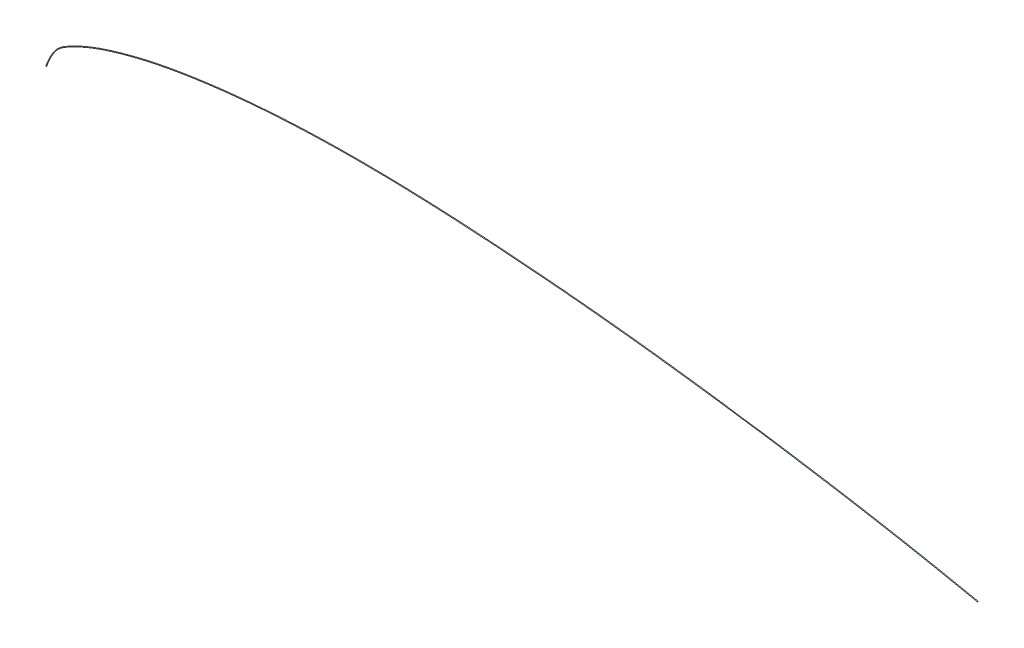
ISO-10303-21;
HEADER;
FILE_DESCRIPTION(('STEP AP214'),'2;1');
FILE_NAME('part.step','',(''),(''),'','','');
FILE_SCHEMA(('AUTOMOTIVE_DESIGN { 1 0 10303 214 1 1 1 1 }'));
ENDSEC;
DATA;
#1=APPLICATION_CONTEXT('core data for automotive mechanical design processes');
#2=APPLICATION_PROTOCOL_DEFINITION('international standard','automotive_design',2000,#1);
#3=PRODUCT_CONTEXT('',#1,'mechanical');
#4=PRODUCT('Part','Part','',(#3));
#5=PRODUCT_RELATED_PRODUCT_CATEGORY('part','',(#4));
#6=PRODUCT_DEFINITION_FORMATION('','',#4);
#7=PRODUCT_DEFINITION_CONTEXT('part definition',#1,'design');
#8=PRODUCT_DEFINITION('design','',#6,#7);
#9=PRODUCT_DEFINITION_SHAPE('','',#8);
#10=(LENGTH_UNIT() NAMED_UNIT(*) SI_UNIT(.MILLI.,.METRE.));
#11=(NAMED_UNIT(*) PLANE_ANGLE_UNIT() SI_UNIT($,.RADIAN.));
#12=(NAMED_UNIT(*) SI_UNIT($,.STERADIAN.) SOLID_ANGLE_UNIT());
#13=UNCERTAINTY_MEASURE_WITH_UNIT(LENGTH_MEASURE(1.E-05),#10,'distance_accuracy_value','');
#14=(GEOMETRIC_REPRESENTATION_CONTEXT(3) GLOBAL_UNCERTAINTY_ASSIGNED_CONTEXT((#13)) GLOBAL_UNIT_ASSIGNED_CONTEXT((#10,
#11,#12)) REPRESENTATION_CONTEXT('',''));
#15=CARTESIAN_POINT('',(0.,0.,0.));
#16=DIRECTION('',(0.,0.,1.));
#17=DIRECTION('',(1.,0.,0.));
#18=AXIS2_PLACEMENT_3D('',#15,#16,#17);
#19=CARTESIAN_POINT('',(1304.66,1.696058,0.));
#20=DIRECTION('',(0.98101772640487,0.193918076721638,0.));
#21=DIRECTION('',(0.,0.,1.));
#22=AXIS2_PLACEMENT_3D('',#19,#20,#21);
#23=PLANE('',#22);
#24=CARTESIAN_POINT('',(1304.66,1.696058,0.));
#25=DIRECTION('',(0.98101772640487,0.193918076721638,0.));
#26=DIRECTION('',(0.,0.,1.));
#27=AXIS2_PLACEMENT_3D('',#24,#25,#26);
#28=CIRCLE('',#27,0.5);
#29=CARTESIAN_POINT('',(1304.66,1.696058,0.5));
#30=VERTEX_POINT('',#29);
#31=EDGE_CURVE('E10',#30,#30,#28,.T.);
#32=ORIENTED_EDGE('',*,*,#31,.T.);
#33=EDGE_LOOP('',(#32));
#34=FACE_BOUND('',#33,.T.);
#35=ADVANCED_FACE('F39',(#34),#23,.T.);
#36=CARTESIAN_POINT('',(1304.66,1.696058,0.5));
#37=CARTESIAN_POINT('',(1282.92772693694,6.14929782340755,0.5));
#38=CARTESIAN_POINT('',(1261.195453882,10.6025376463355,0.5));
#39=CARTESIAN_POINT('',(1206.93838618714,21.2468164795281,0.5));
#40=CARTESIAN_POINT('',(1174.37031889667,27.2178116733628,0.5));
#41=CARTESIAN_POINT('',(1109.1263992094,38.5316321126376,0.5));
#42=CARTESIAN_POINT('',(1076.44825562522,43.8660900637924,0.5));
#43=CARTESIAN_POINT('',(1000.31155481095,55.6370762839409,0.5));
#44=CARTESIAN_POINT('',(956.820964703096,61.8638164249425,0.5));
#45=CARTESIAN_POINT('',(869.842521959019,73.2806504857611,0.5));
#46=CARTESIAN_POINT('',(826.355106530212,78.4740001523558,0.5));
#47=CARTESIAN_POINT('',(739.3698456084,87.4650095892404,0.5));
#48=CARTESIAN_POINT('',(695.872437072038,91.2668809355757,0.5));
#49=CARTESIAN_POINT('',(608.887227843404,97.6405842757081,0.5));
#50=CARTESIAN_POINT('',(565.399633056471,100.215211806732,0.5));
#51=CARTESIAN_POINT('',(478.395079739289,103.309375670061,0.5));
#52=CARTESIAN_POINT('',(434.878268327016,103.83205512042,0.5));
#53=CARTESIAN_POINT('',(347.826991695691,101.780222102428,0.5));
#54=CARTESIAN_POINT('',(304.279102157574,99.2352342375905,0.5));
#55=CARTESIAN_POINT('',(239.007528356002,92.4337100888985,0.5));
#56=CARTESIAN_POINT('',(217.137883231133,89.6354637061965,0.5));
#57=CARTESIAN_POINT('',(173.5760451149,82.7322944815344,0.5));
#58=CARTESIAN_POINT('',(151.884626005489,78.6259584178591,0.5));
#59=CARTESIAN_POINT('',(119.431730282466,70.7870655388134,0.5));
#60=CARTESIAN_POINT('',(108.469841313403,67.8385442853681,0.5));
#61=CARTESIAN_POINT('',(86.6531895763216,61.4142545774094,0.5));
#62=CARTESIAN_POINT('',(75.800572724708,57.9356519815337,0.5));
#63=CARTESIAN_POINT('',(58.4131300467896,51.2666959353052,0.5));
#64=CARTESIAN_POINT('',(51.711977333901,48.4116238929897,0.5));
#65=CARTESIAN_POINT('',(41.7677494726042,43.7114014230806,0.5));
#66=CARTESIAN_POINT('',(38.4709237202427,42.0750581987962,0.5));
#67=CARTESIAN_POINT('',(31.9013435093909,38.653392041473,0.5));
#68=CARTESIAN_POINT('',(28.5984661307997,36.8885624123483,0.5));
#69=CARTESIAN_POINT('',(22.2960932132934,33.0021250024146,0.5));
#70=CARTESIAN_POINT('',(19.3072364724937,30.8732794068314,0.5));
#71=CARTESIAN_POINT('',(14.0650864369098,25.9470099814017,0.5));
#72=CARTESIAN_POINT('',(11.8264044231569,23.1380015646142,0.5));
#73=CARTESIAN_POINT('',(5.88042116155558,14.0150452066754,0.5));
#74=CARTESIAN_POINT('',(2.94021057981981,7.00752260419467,0.5));
#75=CARTESIAN_POINT('',(0.,0.,0.5));
#76=CARTESIAN_POINT('',(1304.85391807672,0.71504027359513,0.5));
#77=CARTESIAN_POINT('',(1283.1216450112,5.16828009701831,0.5));
#78=CARTESIAN_POINT('',(1261.39211909736,9.62205097838318,0.5));
#79=CARTESIAN_POINT('',(1207.14871082492,20.2691492072442,0.5));
#80=CARTESIAN_POINT('',(1174.58755684666,26.2416707466145,0.5));
#81=CARTESIAN_POINT('',(1109.35648443649,37.5584393134051,0.5));
#82=CARTESIAN_POINT('',(1076.68427507403,42.8943254938844,0.5));
#83=CARTESIAN_POINT('',(1000.56025923444,54.6684681733289,0.5));
#84=CARTESIAN_POINT('',(957.077048031174,60.8971302794565,0.5));
#85=CARTESIAN_POINT('',(870.113621413838,72.3180677764635,0.5));
#86=CARTESIAN_POINT('',(826.635030147962,77.5139196283311,0.5));
#87=CARTESIAN_POINT('',(739.669980471018,86.5110545440057,0.5));
#88=CARTESIAN_POINT('',(696.182045583137,90.3159707432014,0.5));
#89=CARTESIAN_POINT('',(609.21456273342,96.6956297302292,0.5));
#90=CARTESIAN_POINT('',(565.738812751709,99.2743588163506,0.5));
#91=CARTESIAN_POINT('',(478.763648082635,102.379642465031,0.5));
#92=CARTESIAN_POINT('',(435.265134839953,102.909614172309,0.5));
#93=CARTESIAN_POINT('',(348.257218143032,100.877188017373,0.5));
#94=CARTESIAN_POINT('',(304.732401335284,98.3433407876192,0.5));
#95=CARTESIAN_POINT('',(239.501620102466,91.5641599649611,0.5));
#96=CARTESIAN_POINT('',(217.647362295906,88.7747488836073,0.5));
#97=CARTESIAN_POINT('',(174.119486365586,81.8926097012969,0.5));
#98=CARTESIAN_POINT('',(152.450377648477,77.8007095587956,0.5));
#99=CARTESIAN_POINT('',(120.038154950003,69.9917392674306,0.5));
#100=CARTESIAN_POINT('',(109.089130187921,67.0532199258716,0.5));
#101=CARTESIAN_POINT('',(87.2971444218757,60.6490257118598,0.5));
#102=CARTESIAN_POINT('',(76.4648666324215,57.1872347828332,0.5));
#103=CARTESIAN_POINT('',(59.12213099632,50.5610707814937,0.5));
#104=CARTESIAN_POINT('',(52.4386672790084,47.7241789003536,0.5));
#105=CARTESIAN_POINT('',(42.5201732156656,43.052597025368,0.5));
#106=CARTESIAN_POINT('',(39.2317929793971,41.4260249191439,0.5));
#107=CARTESIAN_POINT('',(32.6786929545262,38.0241909068752,0.5));
#108=CARTESIAN_POINT('',(29.3863151815706,36.2711388312426,0.5));
#109=CARTESIAN_POINT('',(23.1349025019732,32.4559409835558,0.5));
#110=CARTESIAN_POINT('',(20.1832806038605,30.3823821131525,0.5));
#111=CARTESIAN_POINT('',(15.0158859986617,25.6238789457748,0.5));
#112=CARTESIAN_POINT('',(12.7989611667208,22.8970651692601,0.5));
#113=CARTESIAN_POINT('',(6.88665507478732,13.9588208663837,0.5));
#114=CARTESIAN_POINT('',(3.94021057981981,7.00752260419594,0.5));
#115=CARTESIAN_POINT('',(1.,0.,0.5));
#116=CARTESIAN_POINT('',(1304.85391807672,0.71504027359513,-0.5));
#117=CARTESIAN_POINT('',(1283.1216450112,5.16828009701831,-0.5));
#118=CARTESIAN_POINT('',(1261.39211909736,9.62205097838318,-0.5));
#119=CARTESIAN_POINT('',(1207.14871082492,20.2691492072442,-0.5));
#120=CARTESIAN_POINT('',(1174.58755684666,26.2416707466145,-0.5));
#121=CARTESIAN_POINT('',(1109.35648443649,37.5584393134051,-0.5));
#122=CARTESIAN_POINT('',(1076.68427507403,42.8943254938844,-0.5));
#123=CARTESIAN_POINT('',(1000.56025923444,54.6684681733289,-0.5));
#124=CARTESIAN_POINT('',(957.077048031174,60.8971302794565,-0.5));
#125=CARTESIAN_POINT('',(870.113621413838,72.3180677764635,-0.5));
#126=CARTESIAN_POINT('',(826.635030147962,77.5139196283311,-0.5));
#127=CARTESIAN_POINT('',(739.669980471018,86.5110545440057,-0.5));
#128=CARTESIAN_POINT('',(696.182045583137,90.3159707432014,-0.5));
#129=CARTESIAN_POINT('',(609.21456273342,96.6956297302292,-0.5));
#130=CARTESIAN_POINT('',(565.738812751709,99.2743588163506,-0.5));
#131=CARTESIAN_POINT('',(478.763648082635,102.379642465031,-0.5));
#132=CARTESIAN_POINT('',(435.265134839953,102.909614172309,-0.5));
#133=CARTESIAN_POINT('',(348.257218143032,100.877188017373,-0.5));
#134=CARTESIAN_POINT('',(304.732401335284,98.3433407876192,-0.5));
#135=CARTESIAN_POINT('',(239.501620102466,91.5641599649611,-0.5));
#136=CARTESIAN_POINT('',(217.647362295906,88.7747488836073,-0.5));
#137=CARTESIAN_POINT('',(174.119486365586,81.8926097012969,-0.5));
#138=CARTESIAN_POINT('',(152.450377648477,77.8007095587956,-0.5));
#139=CARTESIAN_POINT('',(120.038154950003,69.9917392674306,-0.5));
#140=CARTESIAN_POINT('',(109.089130187921,67.0532199258716,-0.5));
#141=CARTESIAN_POINT('',(87.2971444218757,60.6490257118598,-0.5));
#142=CARTESIAN_POINT('',(76.4648666324215,57.1872347828332,-0.5));
#143=CARTESIAN_POINT('',(59.12213099632,50.5610707814937,-0.5));
#144=CARTESIAN_POINT('',(52.4386672790084,47.7241789003536,-0.5));
#145=CARTESIAN_POINT('',(42.5201732156656,43.052597025368,-0.5));
#146=CARTESIAN_POINT('',(39.2317929793971,41.4260249191439,-0.5));
#147=CARTESIAN_POINT('',(32.6786929545262,38.0241909068752,-0.5));
#148=CARTESIAN_POINT('',(29.3863151815706,36.2711388312426,-0.5));
#149=CARTESIAN_POINT('',(23.1349025019732,32.4559409835558,-0.5));
#150=CARTESIAN_POINT('',(20.1832806038605,30.3823821131525,-0.5));
#151=CARTESIAN_POINT('',(15.0158859986617,25.6238789457748,-0.5));
#152=CARTESIAN_POINT('',(12.7989611667208,22.8970651692601,-0.5));
#153=CARTESIAN_POINT('',(6.88665507478732,13.9588208663837,-0.5));
#154=CARTESIAN_POINT('',(3.94021057981981,7.00752260419594,-0.5));
#155=CARTESIAN_POINT('',(1.,0.,-0.5));
#156=CARTESIAN_POINT('',(1304.66,1.696058,-0.5));
#157=CARTESIAN_POINT('',(1282.92772693694,6.14929782340755,-0.5));
#158=CARTESIAN_POINT('',(1261.195453882,10.6025376463355,-0.5));
#159=CARTESIAN_POINT('',(1206.93838618714,21.2468164795281,-0.5));
#160=CARTESIAN_POINT('',(1174.37031889667,27.2178116733628,-0.5));
#161=CARTESIAN_POINT('',(1109.1263992094,38.5316321126376,-0.5));
#162=CARTESIAN_POINT('',(1076.44825562522,43.8660900637924,-0.5));
#163=CARTESIAN_POINT('',(1000.31155481095,55.6370762839409,-0.5));
#164=CARTESIAN_POINT('',(956.820964703096,61.8638164249425,-0.5));
#165=CARTESIAN_POINT('',(869.842521959019,73.2806504857611,-0.5));
#166=CARTESIAN_POINT('',(826.355106530212,78.4740001523558,-0.5));
#167=CARTESIAN_POINT('',(739.3698456084,87.4650095892404,-0.5));
#168=CARTESIAN_POINT('',(695.872437072038,91.2668809355757,-0.5));
#169=CARTESIAN_POINT('',(608.887227843404,97.6405842757081,-0.5));
#170=CARTESIAN_POINT('',(565.399633056471,100.215211806732,-0.5));
#171=CARTESIAN_POINT('',(478.395079739289,103.309375670061,-0.5));
#172=CARTESIAN_POINT('',(434.878268327016,103.83205512042,-0.5));
#173=CARTESIAN_POINT('',(347.826991695691,101.780222102428,-0.5));
#174=CARTESIAN_POINT('',(304.279102157574,99.2352342375905,-0.5));
#175=CARTESIAN_POINT('',(239.007528356002,92.4337100888985,-0.5));
#176=CARTESIAN_POINT('',(217.137883231133,89.6354637061965,-0.5));
#177=CARTESIAN_POINT('',(173.5760451149,82.7322944815344,-0.5));
#178=CARTESIAN_POINT('',(151.884626005489,78.6259584178591,-0.5));
#179=CARTESIAN_POINT('',(119.431730282466,70.7870655388134,-0.5));
#180=CARTESIAN_POINT('',(108.469841313403,67.8385442853681,-0.5));
#181=CARTESIAN_POINT('',(86.6531895763216,61.4142545774094,-0.5));
#182=CARTESIAN_POINT('',(75.800572724708,57.9356519815337,-0.5));
#183=CARTESIAN_POINT('',(58.4131300467896,51.2666959353052,-0.5));
#184=CARTESIAN_POINT('',(51.711977333901,48.4116238929897,-0.5));
#185=CARTESIAN_POINT('',(41.7677494726042,43.7114014230806,-0.5));
#186=CARTESIAN_POINT('',(38.4709237202427,42.0750581987962,-0.5));
#187=CARTESIAN_POINT('',(31.9013435093909,38.653392041473,-0.5));
#188=CARTESIAN_POINT('',(28.5984661307997,36.8885624123483,-0.5));
#189=CARTESIAN_POINT('',(22.2960932132934,33.0021250024146,-0.5));
#190=CARTESIAN_POINT('',(19.3072364724937,30.8732794068314,-0.5));
#191=CARTESIAN_POINT('',(14.0650864369098,25.9470099814017,-0.5));
#192=CARTESIAN_POINT('',(11.8264044231569,23.1380015646142,-0.5));
#193=CARTESIAN_POINT('',(5.88042116155558,14.0150452066754,-0.5));
#194=CARTESIAN_POINT('',(2.94021057981981,7.00752260419467,-0.5));
#195=CARTESIAN_POINT('',(0.,0.,-0.5));
#196=CARTESIAN_POINT('',(1304.46608192328,2.67707572640487,-0.5));
#197=CARTESIAN_POINT('',(1282.73380886268,7.13031554979678,-0.5));
#198=CARTESIAN_POINT('',(1260.99878866664,11.5830243142878,-0.5));
#199=CARTESIAN_POINT('',(1206.72806154937,22.2244837518121,-0.5));
#200=CARTESIAN_POINT('',(1174.15308094667,28.1939526001111,-0.5));
#201=CARTESIAN_POINT('',(1108.89631398231,39.5048249118702,-0.5));
#202=CARTESIAN_POINT('',(1076.2122361764,44.8378546337004,-0.5));
#203=CARTESIAN_POINT('',(1000.06285038746,56.605684394553,-0.5));
#204=CARTESIAN_POINT('',(956.564881375017,62.8305025704285,-0.5));
#205=CARTESIAN_POINT('',(869.5714225042,74.2432331950586,-0.5));
#206=CARTESIAN_POINT('',(826.075182912462,79.4340806763805,-0.5));
#207=CARTESIAN_POINT('',(739.069710745781,88.4189646344751,-0.5));
#208=CARTESIAN_POINT('',(695.562828560939,92.21779112795,-0.5));
#209=CARTESIAN_POINT('',(608.559892953388,98.5855388211869,-0.5));
#210=CARTESIAN_POINT('',(565.060453361233,101.156064797113,-0.5));
#211=CARTESIAN_POINT('',(478.026511395943,104.239108875092,-0.5));
#212=CARTESIAN_POINT('',(434.491401814078,104.754496068532,-0.5));
#213=CARTESIAN_POINT('',(347.39676524835,102.683256187484,-0.5));
#214=CARTESIAN_POINT('',(303.825802979864,100.127127687562,-0.5));
#215=CARTESIAN_POINT('',(238.513436609538,93.3032602128359,-0.5));
#216=CARTESIAN_POINT('',(216.62840416636,90.4961785287856,-0.5));
#217=CARTESIAN_POINT('',(173.032603864213,83.5719792617719,-0.5));
#218=CARTESIAN_POINT('',(151.3188743625,79.4512072769225,-0.5));
#219=CARTESIAN_POINT('',(118.825305614928,71.5823918101961,-0.5));
#220=CARTESIAN_POINT('',(107.850552438886,68.6238686448646,-0.5));
#221=CARTESIAN_POINT('',(86.0092347307675,62.1794834429589,-0.5));
#222=CARTESIAN_POINT('',(75.1362788169945,58.6840691802343,-0.5));
#223=CARTESIAN_POINT('',(57.7041290972591,51.9723210891166,-0.5));
#224=CARTESIAN_POINT('',(50.9852873887935,49.0990688856258,-0.5));
#225=CARTESIAN_POINT('',(41.0153257295429,44.3702058207931,-0.5));
#226=CARTESIAN_POINT('',(37.7100544610884,42.7240914784485,-0.5));
#227=CARTESIAN_POINT('',(31.1239940642555,39.2825931760708,-0.5));
#228=CARTESIAN_POINT('',(27.8106170800288,37.5059859934541,-0.5));
#229=CARTESIAN_POINT('',(21.4572839246135,33.5483090212734,-0.5));
#230=CARTESIAN_POINT('',(18.431192341127,31.3641767005103,-0.5));
#231=CARTESIAN_POINT('',(13.1142868751578,26.2701410170286,-0.5));
#232=CARTESIAN_POINT('',(10.8538476795929,23.3789379599684,-0.5));
#233=CARTESIAN_POINT('',(4.87418724832385,14.0712695469671,-0.5));
#234=CARTESIAN_POINT('',(1.94021057981981,7.00752260419341,-0.5));
#235=CARTESIAN_POINT('',(-1.,0.,-0.5));
#236=CARTESIAN_POINT('',(1304.46608192328,2.67707572640487,0.5));
#237=CARTESIAN_POINT('',(1282.73380886268,7.13031554979678,0.5));
#238=CARTESIAN_POINT('',(1260.99878866664,11.5830243142878,0.5));
#239=CARTESIAN_POINT('',(1206.72806154937,22.2244837518121,0.5));
#240=CARTESIAN_POINT('',(1174.15308094667,28.1939526001111,0.5));
#241=CARTESIAN_POINT('',(1108.89631398231,39.5048249118702,0.5));
#242=CARTESIAN_POINT('',(1076.2122361764,44.8378546337004,0.5));
#243=CARTESIAN_POINT('',(1000.06285038746,56.605684394553,0.5));
#244=CARTESIAN_POINT('',(956.564881375017,62.8305025704285,0.5));
#245=CARTESIAN_POINT('',(869.5714225042,74.2432331950586,0.5));
#246=CARTESIAN_POINT('',(826.075182912462,79.4340806763805,0.5));
#247=CARTESIAN_POINT('',(739.069710745781,88.4189646344751,0.5));
#248=CARTESIAN_POINT('',(695.562828560939,92.21779112795,0.5));
#249=CARTESIAN_POINT('',(608.559892953388,98.5855388211869,0.5));
#250=CARTESIAN_POINT('',(565.060453361233,101.156064797113,0.5));
#251=CARTESIAN_POINT('',(478.026511395943,104.239108875092,0.5));
#252=CARTESIAN_POINT('',(434.491401814078,104.754496068532,0.5));
#253=CARTESIAN_POINT('',(347.39676524835,102.683256187484,0.5));
#254=CARTESIAN_POINT('',(303.825802979864,100.127127687562,0.5));
#255=CARTESIAN_POINT('',(238.513436609538,93.3032602128359,0.5));
#256=CARTESIAN_POINT('',(216.62840416636,90.4961785287856,0.5));
#257=CARTESIAN_POINT('',(173.032603864213,83.5719792617719,0.5));
#258=CARTESIAN_POINT('',(151.3188743625,79.4512072769225,0.5));
#259=CARTESIAN_POINT('',(118.825305614928,71.5823918101961,0.5));
#260=CARTESIAN_POINT('',(107.850552438886,68.6238686448646,0.5));
#261=CARTESIAN_POINT('',(86.0092347307675,62.1794834429589,0.5));
#262=CARTESIAN_POINT('',(75.1362788169945,58.6840691802343,0.5));
#263=CARTESIAN_POINT('',(57.7041290972591,51.9723210891166,0.5));
#264=CARTESIAN_POINT('',(50.9852873887935,49.0990688856258,0.5));
#265=CARTESIAN_POINT('',(41.0153257295429,44.3702058207931,0.5));
#266=CARTESIAN_POINT('',(37.7100544610884,42.7240914784485,0.5));
#267=CARTESIAN_POINT('',(31.1239940642555,39.2825931760708,0.5));
#268=CARTESIAN_POINT('',(27.8106170800288,37.5059859934541,0.5));
#269=CARTESIAN_POINT('',(21.4572839246135,33.5483090212734,0.5));
#270=CARTESIAN_POINT('',(18.431192341127,31.3641767005103,0.5));
#271=CARTESIAN_POINT('',(13.1142868751578,26.2701410170286,0.5));
#272=CARTESIAN_POINT('',(10.8538476795929,23.3789379599684,0.5));
#273=CARTESIAN_POINT('',(4.87418724832385,14.0712695469671,0.5));
#274=CARTESIAN_POINT('',(1.94021057981981,7.00752260419341,0.5));
#275=CARTESIAN_POINT('',(-1.,0.,0.5));
#276=CARTESIAN_POINT('',(1304.66,1.696058,0.5));
#277=CARTESIAN_POINT('',(1282.92772693694,6.14929782340755,0.5));
#278=CARTESIAN_POINT('',(1261.195453882,10.6025376463355,0.5));
#279=CARTESIAN_POINT('',(1206.93838618714,21.2468164795281,0.5));
#280=CARTESIAN_POINT('',(1174.37031889667,27.2178116733628,0.5));
#281=CARTESIAN_POINT('',(1109.1263992094,38.5316321126376,0.5));
#282=CARTESIAN_POINT('',(1076.44825562522,43.8660900637924,0.5));
#283=CARTESIAN_POINT('',(1000.31155481095,55.6370762839409,0.5));
#284=CARTESIAN_POINT('',(956.820964703096,61.8638164249425,0.5));
#285=CARTESIAN_POINT('',(869.842521959019,73.2806504857611,0.5));
#286=CARTESIAN_POINT('',(826.355106530212,78.4740001523558,0.5));
#287=CARTESIAN_POINT('',(739.3698456084,87.4650095892404,0.5));
#288=CARTESIAN_POINT('',(695.872437072038,91.2668809355757,0.5));
#289=CARTESIAN_POINT('',(608.887227843404,97.6405842757081,0.5));
#290=CARTESIAN_POINT('',(565.399633056471,100.215211806732,0.5));
#291=CARTESIAN_POINT('',(478.395079739289,103.309375670061,0.5));
#292=CARTESIAN_POINT('',(434.878268327016,103.83205512042,0.5));
#293=CARTESIAN_POINT('',(347.826991695691,101.780222102428,0.5));
#294=CARTESIAN_POINT('',(304.279102157574,99.2352342375905,0.5));
#295=CARTESIAN_POINT('',(239.007528356002,92.4337100888985,0.5));
#296=CARTESIAN_POINT('',(217.137883231133,89.6354637061965,0.5));
#297=CARTESIAN_POINT('',(173.5760451149,82.7322944815344,0.5));
#298=CARTESIAN_POINT('',(151.884626005489,78.6259584178591,0.5));
#299=CARTESIAN_POINT('',(119.431730282466,70.7870655388134,0.5));
#300=CARTESIAN_POINT('',(108.469841313403,67.8385442853681,0.5));
#301=CARTESIAN_POINT('',(86.6531895763216,61.4142545774094,0.5));
#302=CARTESIAN_POINT('',(75.800572724708,57.9356519815337,0.5));
#303=CARTESIAN_POINT('',(58.4131300467896,51.2666959353052,0.5));
#304=CARTESIAN_POINT('',(51.711977333901,48.4116238929897,0.5));
#305=CARTESIAN_POINT('',(41.7677494726042,43.7114014230806,0.5));
#306=CARTESIAN_POINT('',(38.4709237202427,42.0750581987962,0.5));
#307=CARTESIAN_POINT('',(31.9013435093909,38.653392041473,0.5));
#308=CARTESIAN_POINT('',(28.5984661307997,36.8885624123483,0.5));
#309=CARTESIAN_POINT('',(22.2960932132934,33.0021250024146,0.5));
#310=CARTESIAN_POINT('',(19.3072364724937,30.8732794068314,0.5));
#311=CARTESIAN_POINT('',(14.0650864369098,25.9470099814017,0.5));
#312=CARTESIAN_POINT('',(11.8264044231569,23.1380015646142,0.5));
#313=CARTESIAN_POINT('',(5.88042116155558,14.0150452066754,0.5));
#314=CARTESIAN_POINT('',(2.94021057981981,7.00752260419467,0.5));
#315=CARTESIAN_POINT('',(0.,0.,0.5));
#316=(BOUNDED_SURFACE() B_SPLINE_SURFACE(3,3,((#36,#37,#38,#39,#40,#41,#42,#43,#44,#45,#46,#47,
#48,#49,#50,#51,#52,#53,#54,#55,#56,#57,#58,#59,#60,#61,#62,#63,#64,#65,#66,#67,#68,#69,#70,#71,
#72,#73,#74,#75),(#76,#77,#78,#79,#80,#81,#82,#83,#84,#85,#86,#87,#88,#89,#90,#91,#92,#93,#94,
#95,#96,#97,#98,#99,#100,#101,#102,#103,#104,#105,#106,#107,#108,#109,#110,#111,#112,#113,#114,
#115),(#116,#117,#118,#119,#120,#121,#122,#123,#124,#125,#126,#127,#128,#129,#130,#131,#132,
#133,#134,#135,#136,#137,#138,#139,#140,#141,#142,#143,#144,#145,#146,#147,#148,#149,#150,#151,
#152,#153,#154,#155),(#156,#157,#158,#159,#160,#161,#162,#163,#164,#165,#166,#167,#168,#169,
#170,#171,#172,#173,#174,#175,#176,#177,#178,#179,#180,#181,#182,#183,#184,#185,#186,#187,#188,
#189,#190,#191,#192,#193,#194,#195),(#196,#197,#198,#199,#200,#201,#202,#203,#204,#205,#206,
#207,#208,#209,#210,#211,#212,#213,#214,#215,#216,#217,#218,#219,#220,#221,#222,#223,#224,#225,
#226,#227,#228,#229,#230,#231,#232,#233,#234,#235),(#236,#237,#238,#239,#240,#241,#242,#243,
#244,#245,#246,#247,#248,#249,#250,#251,#252,#253,#254,#255,#256,#257,#258,#259,#260,#261,#262,
#263,#264,#265,#266,#267,#268,#269,#270,#271,#272,#273,#274,#275),(#276,#277,#278,#279,#280,
#281,#282,#283,#284,#285,#286,#287,#288,#289,#290,#291,#292,#293,#294,#295,#296,#297,#298,#299,
#300,#301,#302,#303,#304,#305,#306,#307,#308,#309,#310,#311,#312,#313,#314,#315)),.UNSPECIFIED.,
.T.,.F.,.F.) B_SPLINE_SURFACE_WITH_KNOTS((4,3,4),(4,2,2,2,2,2,2,2,2,2,2,2,2,2,2,2,2,2,2,4),(0.,
0.5,1.),(0.,0.0496812988513006,0.123828803347963,0.197976307844626,0.296362491062684,
0.394433617199178,0.492205408317245,0.589753408165242,0.687151928165724,0.784753711389578,
0.834119584128113,0.883485456866648,0.908917356863356,0.934349256860064,0.950761942645048,
0.95896828553754,0.967174628430032,0.975380971322524,0.983587314215016,1.),
.UNSPECIFIED.) GEOMETRIC_REPRESENTATION_ITEM() RATIONAL_B_SPLINE_SURFACE(((1.,1.,1.,1.,1.,1.,1.,
1.,1.,1.,1.,1.,1.,1.,1.,1.,1.,1.,1.,1.,1.,1.,1.,1.,1.,1.,1.,1.,1.,1.,1.,1.,1.,1.,1.,1.,1.,1.,1.,
1.),(0.333333333333333,0.333333333333333,0.333333333333333,0.333333333333333,0.333333333333333,
0.333333333333333,0.333333333333333,0.333333333333333,0.333333333333333,0.333333333333333,
0.333333333333333,0.333333333333333,0.333333333333333,0.333333333333333,0.333333333333333,
0.333333333333333,0.333333333333333,0.333333333333333,0.333333333333333,0.333333333333333,
0.333333333333333,0.333333333333333,0.333333333333333,0.333333333333333,0.333333333333333,
0.333333333333333,0.333333333333333,0.333333333333333,0.333333333333333,0.333333333333333,
0.333333333333333,0.333333333333333,0.333333333333333,0.333333333333333,0.333333333333333,
0.333333333333333,0.333333333333333,0.333333333333333,0.333333333333333,0.333333333333333),
(0.333333333333333,0.333333333333333,0.333333333333333,0.333333333333333,0.333333333333333,
0.333333333333333,0.333333333333333,0.333333333333333,0.333333333333333,0.333333333333333,
0.333333333333333,0.333333333333333,0.333333333333333,0.333333333333333,0.333333333333333,
0.333333333333333,0.333333333333333,0.333333333333333,0.333333333333333,0.333333333333333,
0.333333333333333,0.333333333333333,0.333333333333333,0.333333333333333,0.333333333333333,
0.333333333333333,0.333333333333333,0.333333333333333,0.333333333333333,0.333333333333333,
0.333333333333333,0.333333333333333,0.333333333333333,0.333333333333333,0.333333333333333,
0.333333333333333,0.333333333333333,0.333333333333333,0.333333333333333,0.333333333333333),(1.,
1.,1.,1.,1.,1.,1.,1.,1.,1.,1.,1.,1.,1.,1.,1.,1.,1.,1.,1.,1.,1.,1.,1.,1.,1.,1.,1.,1.,1.,1.,1.,1.,
1.,1.,1.,1.,1.,1.,1.),(0.333333333333333,0.333333333333333,0.333333333333333,0.333333333333333,
0.333333333333333,0.333333333333333,0.333333333333333,0.333333333333333,0.333333333333333,
0.333333333333333,0.333333333333333,0.333333333333333,0.333333333333333,0.333333333333333,
0.333333333333333,0.333333333333333,0.333333333333333,0.333333333333333,0.333333333333333,
0.333333333333333,0.333333333333333,0.333333333333333,0.333333333333333,0.333333333333333,
0.333333333333333,0.333333333333333,0.333333333333333,0.333333333333333,0.333333333333333,
0.333333333333333,0.333333333333333,0.333333333333333,0.333333333333333,0.333333333333333,
0.333333333333333,0.333333333333333,0.333333333333333,0.333333333333333,0.333333333333333,
0.333333333333333),(0.333333333333333,0.333333333333333,0.333333333333333,0.333333333333333,
0.333333333333333,0.333333333333333,0.333333333333333,0.333333333333333,0.333333333333333,
0.333333333333333,0.333333333333333,0.333333333333333,0.333333333333333,0.333333333333333,
0.333333333333333,0.333333333333333,0.333333333333333,0.333333333333333,0.333333333333333,
0.333333333333333,0.333333333333333,0.333333333333333,0.333333333333333,0.333333333333333,
0.333333333333333,0.333333333333333,0.333333333333333,0.333333333333333,0.333333333333333,
0.333333333333333,0.333333333333333,0.333333333333333,0.333333333333333,0.333333333333333,
0.333333333333333,0.333333333333333,0.333333333333333,0.333333333333333,0.333333333333333,
0.333333333333333),(1.,1.,1.,1.,1.,1.,1.,1.,1.,1.,1.,1.,1.,1.,1.,1.,1.,1.,1.,1.,1.,1.,1.,1.,1.,
1.,1.,1.,1.,1.,1.,1.,1.,1.,1.,1.,1.,1.,1.,1.))) REPRESENTATION_ITEM('') SURFACE());
#317=CARTESIAN_POINT('',(0.,0.,0.));
#318=DIRECTION('',(0.,1.,0.));
#319=DIRECTION('',(0.,0.,1.));
#320=AXIS2_PLACEMENT_3D('',#317,#318,#319);
#321=CIRCLE('',#320,0.5);
#322=CARTESIAN_POINT('',(0.,0.,0.5));
#323=VERTEX_POINT('',#322);
#324=EDGE_CURVE('E49',#323,#323,#321,.T.);
#325=ORIENTED_EDGE('',*,*,#324,.T.);
#326=EDGE_LOOP('',(#325));
#327=FACE_BOUND('',#326,.T.);
#328=ORIENTED_EDGE('',*,*,#31,.F.);
#329=EDGE_LOOP('',(#328));
#330=FACE_BOUND('',#329,.T.);
#331=ADVANCED_FACE('F56',(#327,#330),#316,.F.);
#332=CARTESIAN_POINT('',(0.,-1.,0.));
#333=DIRECTION('',(0.,1.,0.));
#334=DIRECTION('',(0.,0.,1.));
#335=AXIS2_PLACEMENT_3D('',#332,#333,#334);
#336=CYLINDRICAL_SURFACE('',#335,0.5);
#337=CARTESIAN_POINT('',(0.,-1.,0.));
#338=DIRECTION('',(0.,1.,0.));
#339=DIRECTION('',(0.,0.,1.));
#340=AXIS2_PLACEMENT_3D('',#337,#338,#339);
#341=CIRCLE('',#340,0.5);
#342=CARTESIAN_POINT('',(0.,-1.,0.5));
#343=VERTEX_POINT('',#342);
#344=EDGE_CURVE('E45',#343,#343,#341,.T.);
#345=ORIENTED_EDGE('',*,*,#344,.T.);
#346=EDGE_LOOP('',(#345));
#347=FACE_BOUND('',#346,.T.);
#348=ORIENTED_EDGE('',*,*,#324,.F.);
#349=EDGE_LOOP('',(#348));
#350=FACE_BOUND('',#349,.T.);
#351=ADVANCED_FACE('F59',(#347,#350),#336,.T.);
#352=CARTESIAN_POINT('',(0.,-1.,0.));
#353=DIRECTION('',(0.,1.,0.));
#354=DIRECTION('',(0.,0.,1.));
#355=AXIS2_PLACEMENT_3D('',#352,#353,#354);
#356=PLANE('',#355);
#357=ORIENTED_EDGE('',*,*,#344,.F.);
#358=EDGE_LOOP('',(#357));
#359=FACE_BOUND('',#358,.T.);
#360=ADVANCED_FACE('F61',(#359),#356,.F.);
#361=CLOSED_SHELL('',(#35,#331,#351,#360));
#362=MANIFOLD_SOLID_BREP('B2',#361);
#363=ADVANCED_BREP_SHAPE_REPRESENTATION('',(#18,#362),#14);
#364=SHAPE_DEFINITION_REPRESENTATION(#9,#363);
ENDSEC;
END-ISO-10303-21;
